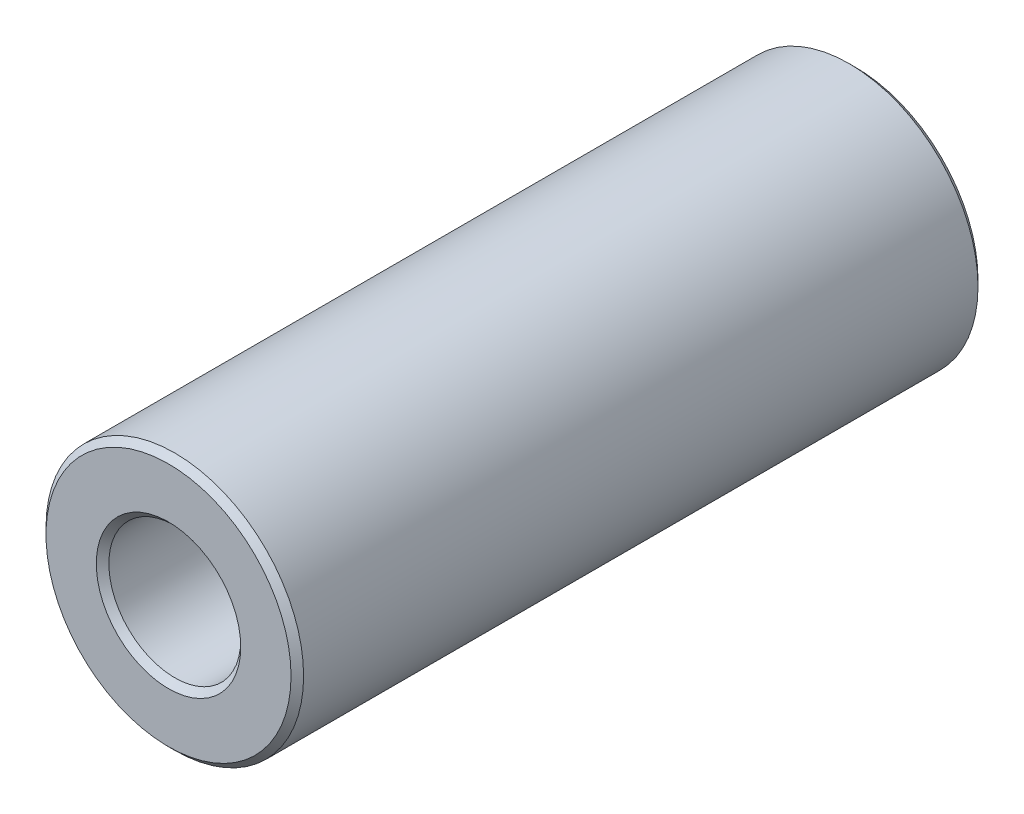
ISO-10303-21;
HEADER;
FILE_DESCRIPTION(('STEP AP214'),'2;1');
FILE_NAME('part.step','',(''),(''),'','','');
FILE_SCHEMA(('AUTOMOTIVE_DESIGN { 1 0 10303 214 1 1 1 1 }'));
ENDSEC;
DATA;
#1=APPLICATION_CONTEXT('core data for automotive mechanical design processes');
#2=APPLICATION_PROTOCOL_DEFINITION('international standard','automotive_design',2000,#1);
#3=PRODUCT_CONTEXT('',#1,'mechanical');
#4=PRODUCT('Part','Part','',(#3));
#5=PRODUCT_RELATED_PRODUCT_CATEGORY('part','',(#4));
#6=PRODUCT_DEFINITION_FORMATION('','',#4);
#7=PRODUCT_DEFINITION_CONTEXT('part definition',#1,'design');
#8=PRODUCT_DEFINITION('design','',#6,#7);
#9=PRODUCT_DEFINITION_SHAPE('','',#8);
#10=(LENGTH_UNIT() NAMED_UNIT(*) SI_UNIT(.MILLI.,.METRE.));
#11=(NAMED_UNIT(*) PLANE_ANGLE_UNIT() SI_UNIT($,.RADIAN.));
#12=(NAMED_UNIT(*) SI_UNIT($,.STERADIAN.) SOLID_ANGLE_UNIT());
#13=UNCERTAINTY_MEASURE_WITH_UNIT(LENGTH_MEASURE(1.E-05),#10,'distance_accuracy_value','');
#14=(GEOMETRIC_REPRESENTATION_CONTEXT(3) GLOBAL_UNCERTAINTY_ASSIGNED_CONTEXT((#13)) GLOBAL_UNIT_ASSIGNED_CONTEXT((#10,
#11,#12)) REPRESENTATION_CONTEXT('',''));
#15=CARTESIAN_POINT('',(0.,0.,0.));
#16=DIRECTION('',(0.,0.,1.));
#17=DIRECTION('',(1.,0.,0.));
#18=AXIS2_PLACEMENT_3D('',#15,#16,#17);
#19=CARTESIAN_POINT('',(0.,0.,-12.7));
#20=DIRECTION('',(0.,0.,1.));
#21=DIRECTION('',(1.,0.,0.));
#22=AXIS2_PLACEMENT_3D('',#19,#20,#21);
#23=CYLINDRICAL_SURFACE('',#22,4.7625);
#24=CARTESIAN_POINT('',(0.,0.,12.46759));
#25=DIRECTION('',(0.,0.,1.));
#26=DIRECTION('',(1.,0.,0.));
#27=AXIS2_PLACEMENT_3D('',#24,#25,#26);
#28=CIRCLE('',#27,4.7625);
#29=CARTESIAN_POINT('',(4.7625,0.,12.46759));
#30=VERTEX_POINT('',#29);
#31=EDGE_CURVE('E50',#30,#30,#28,.F.);
#32=ORIENTED_EDGE('',*,*,#31,.T.);
#33=EDGE_LOOP('',(#32));
#34=FACE_BOUND('',#33,.T.);
#35=CARTESIAN_POINT('',(0.,0.,-12.46759));
#36=DIRECTION('',(0.,0.,1.));
#37=DIRECTION('',(1.,0.,0.));
#38=AXIS2_PLACEMENT_3D('',#35,#36,#37);
#39=CIRCLE('',#38,4.7625);
#40=CARTESIAN_POINT('',(4.7625,0.,-12.46759));
#41=VERTEX_POINT('',#40);
#42=EDGE_CURVE('E53',#41,#41,#39,.T.);
#43=ORIENTED_EDGE('',*,*,#42,.T.);
#44=EDGE_LOOP('',(#43));
#45=FACE_BOUND('',#44,.T.);
#46=ADVANCED_FACE('F30',(#34,#45),#23,.T.);
#47=CARTESIAN_POINT('',(0.,0.,-12.7));
#48=DIRECTION('',(0.,0.,1.));
#49=DIRECTION('',(1.,0.,0.));
#50=AXIS2_PLACEMENT_3D('',#47,#48,#49);
#51=PLANE('',#50);
#52=CARTESIAN_POINT('',(0.,0.,-12.7));
#53=DIRECTION('',(0.,0.,1.));
#54=DIRECTION('',(1.,0.,0.));
#55=AXIS2_PLACEMENT_3D('',#52,#53,#54);
#56=CIRCLE('',#55,4.53008999999999);
#57=CARTESIAN_POINT('',(4.53008999999999,0.,-12.7));
#58=VERTEX_POINT('',#57);
#59=EDGE_CURVE('E41',#58,#58,#56,.F.);
#60=ORIENTED_EDGE('',*,*,#59,.T.);
#61=EDGE_LOOP('',(#60));
#62=FACE_BOUND('',#61,.T.);
#63=CARTESIAN_POINT('',(0.,0.,-12.7));
#64=DIRECTION('',(0.,0.,1.));
#65=DIRECTION('',(1.,0.,0.));
#66=AXIS2_PLACEMENT_3D('',#63,#64,#65);
#67=CIRCLE('',#66,2.67081);
#68=CARTESIAN_POINT('',(2.67081,0.,-12.7));
#69=VERTEX_POINT('',#68);
#70=EDGE_CURVE('E45',#69,#69,#67,.T.);
#71=ORIENTED_EDGE('',*,*,#70,.T.);
#72=EDGE_LOOP('',(#71));
#73=FACE_BOUND('',#72,.T.);
#74=ADVANCED_FACE('F78',(#62,#73),#51,.F.);
#75=CARTESIAN_POINT('',(0.,0.,-12.7));
#76=DIRECTION('',(0.,0.,1.));
#77=DIRECTION('',(1.,0.,0.));
#78=AXIS2_PLACEMENT_3D('',#75,#76,#77);
#79=CYLINDRICAL_SURFACE('',#78,2.4384);
#80=CARTESIAN_POINT('',(0.,0.,12.46759));
#81=DIRECTION('',(0.,0.,1.));
#82=DIRECTION('',(1.,0.,0.));
#83=AXIS2_PLACEMENT_3D('',#80,#81,#82);
#84=CIRCLE('',#83,2.4384);
#85=CARTESIAN_POINT('',(2.4384,0.,12.46759));
#86=VERTEX_POINT('',#85);
#87=EDGE_CURVE('E10',#86,#86,#84,.T.);
#88=ORIENTED_EDGE('',*,*,#87,.T.);
#89=EDGE_LOOP('',(#88));
#90=FACE_BOUND('',#89,.T.);
#91=CARTESIAN_POINT('',(0.,0.,-12.46759));
#92=DIRECTION('',(0.,0.,1.));
#93=DIRECTION('',(1.,0.,0.));
#94=AXIS2_PLACEMENT_3D('',#91,#92,#93);
#95=CIRCLE('',#94,2.4384);
#96=CARTESIAN_POINT('',(2.4384,0.,-12.46759));
#97=VERTEX_POINT('',#96);
#98=EDGE_CURVE('E37',#97,#97,#95,.F.);
#99=ORIENTED_EDGE('',*,*,#98,.T.);
#100=EDGE_LOOP('',(#99));
#101=FACE_BOUND('',#100,.T.);
#102=ADVANCED_FACE('F84',(#90,#101),#79,.F.);
#103=CARTESIAN_POINT('',(0.,0.,12.7));
#104=DIRECTION('',(0.,0.,1.));
#105=DIRECTION('',(1.,0.,0.));
#106=AXIS2_PLACEMENT_3D('',#103,#104,#105);
#107=PLANE('',#106);
#108=CARTESIAN_POINT('',(0.,0.,12.7));
#109=DIRECTION('',(0.,0.,1.));
#110=DIRECTION('',(1.,0.,0.));
#111=AXIS2_PLACEMENT_3D('',#108,#109,#110);
#112=CIRCLE('',#111,4.53009);
#113=CARTESIAN_POINT('',(4.53009,0.,12.7));
#114=VERTEX_POINT('',#113);
#115=EDGE_CURVE('E56',#114,#114,#112,.T.);
#116=ORIENTED_EDGE('',*,*,#115,.T.);
#117=EDGE_LOOP('',(#116));
#118=FACE_BOUND('',#117,.T.);
#119=CARTESIAN_POINT('',(0.,0.,12.7));
#120=DIRECTION('',(0.,0.,1.));
#121=DIRECTION('',(1.,0.,0.));
#122=AXIS2_PLACEMENT_3D('',#119,#120,#121);
#123=CIRCLE('',#122,2.67081);
#124=CARTESIAN_POINT('',(2.67081,0.,12.7));
#125=VERTEX_POINT('',#124);
#126=EDGE_CURVE('E59',#125,#125,#123,.F.);
#127=ORIENTED_EDGE('',*,*,#126,.T.);
#128=EDGE_LOOP('',(#127));
#129=FACE_BOUND('',#128,.T.);
#130=ADVANCED_FACE('F63',(#118,#129),#107,.T.);
#131=CARTESIAN_POINT('',(0.,0.,12.7));
#132=DIRECTION('',(0.,0.,-1.));
#133=DIRECTION('',(-1.,0.,0.));
#134=AXIS2_PLACEMENT_3D('',#131,#132,#133);
#135=CONICAL_SURFACE('',#134,4.53009,0.785398163397443);
#136=ORIENTED_EDGE('',*,*,#31,.F.);
#137=EDGE_LOOP('',(#136));
#138=FACE_BOUND('',#137,.T.);
#139=ORIENTED_EDGE('',*,*,#115,.F.);
#140=EDGE_LOOP('',(#139));
#141=FACE_BOUND('',#140,.T.);
#142=ADVANCED_FACE('F74',(#138,#141),#135,.T.);
#143=CARTESIAN_POINT('',(0.,0.,-12.46759));
#144=DIRECTION('',(0.,0.,1.));
#145=DIRECTION('',(1.,0.,0.));
#146=AXIS2_PLACEMENT_3D('',#143,#144,#145);
#147=CONICAL_SURFACE('',#146,4.7625,0.78539816339745);
#148=ORIENTED_EDGE('',*,*,#59,.F.);
#149=EDGE_LOOP('',(#148));
#150=FACE_BOUND('',#149,.T.);
#151=ORIENTED_EDGE('',*,*,#42,.F.);
#152=EDGE_LOOP('',(#151));
#153=FACE_BOUND('',#152,.T.);
#154=ADVANCED_FACE('F68',(#150,#153),#147,.T.);
#155=CARTESIAN_POINT('',(0.,0.,12.46759));
#156=DIRECTION('',(0.,0.,1.));
#157=DIRECTION('',(1.,0.,0.));
#158=AXIS2_PLACEMENT_3D('',#155,#156,#157);
#159=CONICAL_SURFACE('',#158,2.4384,0.785398163397441);
#160=ORIENTED_EDGE('',*,*,#126,.F.);
#161=EDGE_LOOP('',(#160));
#162=FACE_BOUND('',#161,.T.);
#163=ORIENTED_EDGE('',*,*,#87,.F.);
#164=EDGE_LOOP('',(#163));
#165=FACE_BOUND('',#164,.T.);
#166=ADVANCED_FACE('F65',(#162,#165),#159,.F.);
#167=CARTESIAN_POINT('',(0.,0.,-12.7));
#168=DIRECTION('',(0.,0.,-1.));
#169=DIRECTION('',(-1.,0.,0.));
#170=AXIS2_PLACEMENT_3D('',#167,#168,#169);
#171=CONICAL_SURFACE('',#170,2.67081,0.785398163397448);
#172=ORIENTED_EDGE('',*,*,#98,.F.);
#173=EDGE_LOOP('',(#172));
#174=FACE_BOUND('',#173,.T.);
#175=ORIENTED_EDGE('',*,*,#70,.F.);
#176=EDGE_LOOP('',(#175));
#177=FACE_BOUND('',#176,.T.);
#178=ADVANCED_FACE('F32',(#174,#177),#171,.F.);
#179=CLOSED_SHELL('',(#46,#74,#102,#130,#142,#154,#166,#178));
#180=MANIFOLD_SOLID_BREP('B2',#179);
#181=ADVANCED_BREP_SHAPE_REPRESENTATION('',(#18,#180),#14);
#182=SHAPE_DEFINITION_REPRESENTATION(#9,#181);
ENDSEC;
END-ISO-10303-21;
